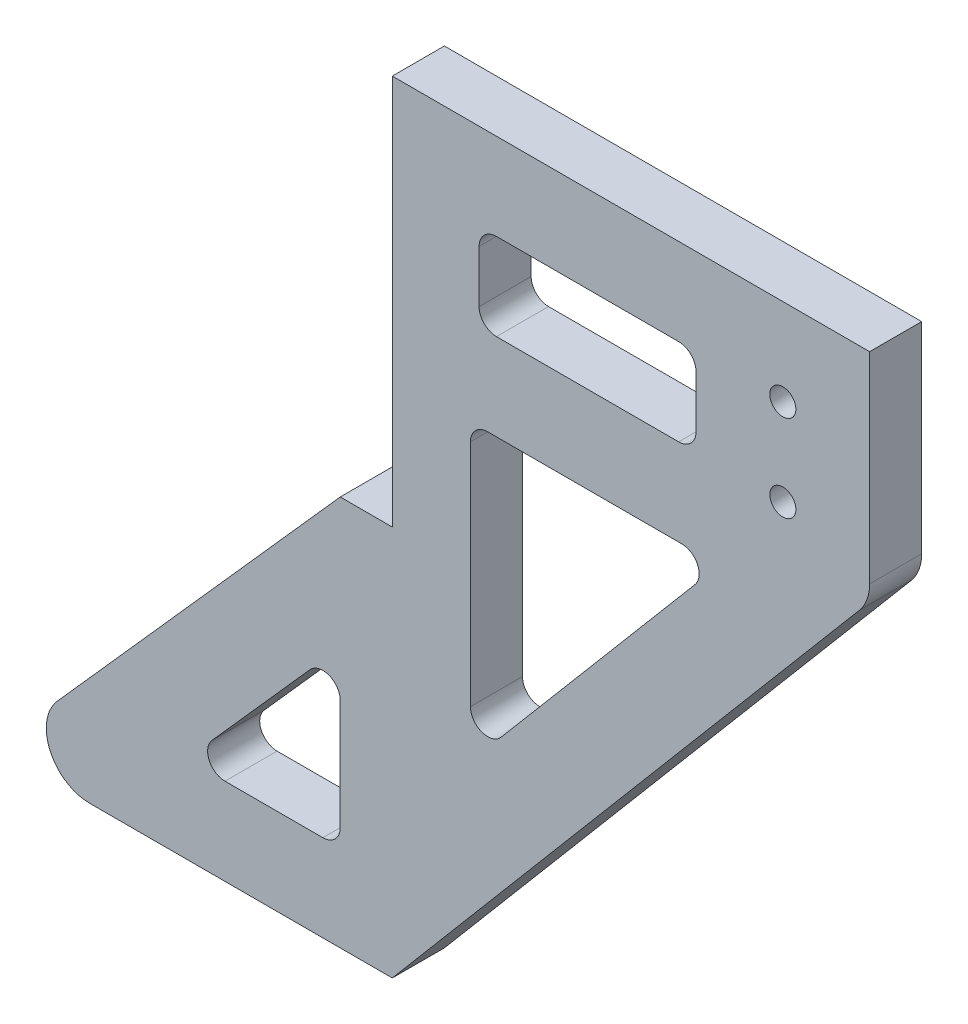
ISO-10303-21;
HEADER;
FILE_DESCRIPTION(('STEP AP214'),'2;1');
FILE_NAME('part.step','',(''),(''),'','','');
FILE_SCHEMA(('AUTOMOTIVE_DESIGN { 1 0 10303 214 1 1 1 1 }'));
ENDSEC;
DATA;
#1=APPLICATION_CONTEXT('core data for automotive mechanical design processes');
#2=APPLICATION_PROTOCOL_DEFINITION('international standard','automotive_design',2000,#1);
#3=PRODUCT_CONTEXT('',#1,'mechanical');
#4=PRODUCT('Part','Part','',(#3));
#5=PRODUCT_RELATED_PRODUCT_CATEGORY('part','',(#4));
#6=PRODUCT_DEFINITION_FORMATION('','',#4);
#7=PRODUCT_DEFINITION_CONTEXT('part definition',#1,'design');
#8=PRODUCT_DEFINITION('design','',#6,#7);
#9=PRODUCT_DEFINITION_SHAPE('','',#8);
#10=(LENGTH_UNIT() NAMED_UNIT(*) SI_UNIT(.MILLI.,.METRE.));
#11=(NAMED_UNIT(*) PLANE_ANGLE_UNIT() SI_UNIT($,.RADIAN.));
#12=(NAMED_UNIT(*) SI_UNIT($,.STERADIAN.) SOLID_ANGLE_UNIT());
#13=UNCERTAINTY_MEASURE_WITH_UNIT(LENGTH_MEASURE(1.E-05),#10,'distance_accuracy_value','');
#14=(GEOMETRIC_REPRESENTATION_CONTEXT(3) GLOBAL_UNCERTAINTY_ASSIGNED_CONTEXT((#13)) GLOBAL_UNIT_ASSIGNED_CONTEXT((#10,
#11,#12)) REPRESENTATION_CONTEXT('',''));
#15=CARTESIAN_POINT('',(0.,0.,0.));
#16=DIRECTION('',(0.,0.,1.));
#17=DIRECTION('',(1.,0.,0.));
#18=AXIS2_PLACEMENT_3D('',#15,#16,#17);
#19=CARTESIAN_POINT('',(0.,0.,6.));
#20=DIRECTION('',(1.,0.,0.));
#21=DIRECTION('',(0.,1.,0.));
#22=AXIS2_PLACEMENT_3D('',#19,#20,#21);
#23=PLANE('',#22);
#24=DIRECTION('',(0.,-1.,0.));
#25=VECTOR('',#24,1.);
#26=CARTESIAN_POINT('',(0.,0.,0.));
#27=LINE('',#26,#25);
#28=CARTESIAN_POINT('',(0.,0.,0.));
#29=VERTEX_POINT('',#28);
#30=CARTESIAN_POINT('',(0.,-45.,0.));
#31=VERTEX_POINT('',#30);
#32=EDGE_CURVE('E247',#29,#31,#27,.T.);
#33=ORIENTED_EDGE('',*,*,#32,.T.);
#34=DIRECTION('',(0.,0.,-1.));
#35=VECTOR('',#34,1.);
#36=CARTESIAN_POINT('',(0.,-45.,6.));
#37=LINE('',#36,#35);
#38=CARTESIAN_POINT('',(0.,-45.,6.));
#39=VERTEX_POINT('',#38);
#40=EDGE_CURVE('E229',#39,#31,#37,.T.);
#41=ORIENTED_EDGE('',*,*,#40,.F.);
#42=DIRECTION('',(0.,-1.,0.));
#43=VECTOR('',#42,1.);
#44=CARTESIAN_POINT('',(0.,0.,6.));
#45=LINE('',#44,#43);
#46=CARTESIAN_POINT('',(0.,0.,6.));
#47=VERTEX_POINT('',#46);
#48=EDGE_CURVE('E234',#47,#39,#45,.T.);
#49=ORIENTED_EDGE('',*,*,#48,.F.);
#50=DIRECTION('',(0.,0.,-1.));
#51=VECTOR('',#50,1.);
#52=CARTESIAN_POINT('',(0.,0.,6.));
#53=LINE('',#52,#51);
#54=EDGE_CURVE('E381',#47,#29,#53,.T.);
#55=ORIENTED_EDGE('',*,*,#54,.T.);
#56=EDGE_LOOP('',(#33,#41,#49,#55));
#57=FACE_BOUND('',#56,.T.);
#58=ADVANCED_FACE('F34',(#57),#23,.F.);
#59=CARTESIAN_POINT('',(0.,-45.,6.));
#60=DIRECTION('',(0.,-1.,0.));
#61=DIRECTION('',(0.,0.,-1.));
#62=AXIS2_PLACEMENT_3D('',#59,#60,#61);
#63=PLANE('',#62);
#64=DIRECTION('',(-1.,0.,0.));
#65=VECTOR('',#64,1.);
#66=CARTESIAN_POINT('',(0.,-45.,0.));
#67=LINE('',#66,#65);
#68=CARTESIAN_POINT('',(-6.,-45.,0.));
#69=VERTEX_POINT('',#68);
#70=EDGE_CURVE('E375',#31,#69,#67,.T.);
#71=ORIENTED_EDGE('',*,*,#70,.T.);
#72=DIRECTION('',(0.,0.,-1.));
#73=VECTOR('',#72,1.);
#74=CARTESIAN_POINT('',(-6.,-45.,6.));
#75=LINE('',#74,#73);
#76=CARTESIAN_POINT('',(-6.,-45.,6.));
#77=VERTEX_POINT('',#76);
#78=EDGE_CURVE('E232',#77,#69,#75,.T.);
#79=ORIENTED_EDGE('',*,*,#78,.F.);
#80=DIRECTION('',(-1.,0.,0.));
#81=VECTOR('',#80,1.);
#82=CARTESIAN_POINT('',(0.,-45.,6.));
#83=LINE('',#82,#81);
#84=EDGE_CURVE('E225',#39,#77,#83,.T.);
#85=ORIENTED_EDGE('',*,*,#84,.F.);
#86=ORIENTED_EDGE('',*,*,#40,.T.);
#87=EDGE_LOOP('',(#71,#79,#85,#86));
#88=FACE_BOUND('',#87,.T.);
#89=ADVANCED_FACE('F227',(#88),#63,.F.);
#90=CARTESIAN_POINT('',(-6.,-45.,6.));
#91=DIRECTION('',(0.74740931868366,-0.66436383882992,0.));
#92=DIRECTION('',(0.66436383882992,0.74740931868366,0.));
#93=AXIS2_PLACEMENT_3D('',#90,#91,#92);
#94=PLANE('',#93);
#95=DIRECTION('',(-0.66436383882992,-0.74740931868366,0.));
#96=VECTOR('',#95,1.);
#97=CARTESIAN_POINT('',(-6.,-45.,0.));
#98=LINE('',#97,#96);
#99=CARTESIAN_POINT('',(-38.6028273829781,-81.6781808058504,0.));
#100=VERTEX_POINT('',#99);
#101=EDGE_CURVE('E371',#69,#100,#98,.T.);
#102=ORIENTED_EDGE('',*,*,#101,.T.);
#103=DIRECTION('',(0.,0.,-1.));
#104=VECTOR('',#103,1.);
#105=CARTESIAN_POINT('',(-38.6028273829781,-81.6781808058504,6.));
#106=LINE('',#105,#104);
#107=CARTESIAN_POINT('',(-38.6028273829781,-81.6781808058504,6.));
#108=VERTEX_POINT('',#107);
#109=EDGE_CURVE('E11',#100,#108,#106,.F.);
#110=ORIENTED_EDGE('',*,*,#109,.T.);
#111=DIRECTION('',(-0.66436383882992,-0.74740931868366,0.));
#112=VECTOR('',#111,1.);
#113=CARTESIAN_POINT('',(-6.,-45.,6.));
#114=LINE('',#113,#112);
#115=EDGE_CURVE('E233',#77,#108,#114,.T.);
#116=ORIENTED_EDGE('',*,*,#115,.F.);
#117=ORIENTED_EDGE('',*,*,#78,.T.);
#118=EDGE_LOOP('',(#102,#110,#116,#117));
#119=FACE_BOUND('',#118,.T.);
#120=ADVANCED_FACE('F399',(#119),#94,.F.);
#121=CARTESIAN_POINT('',(-46.,-90.,6.));
#122=DIRECTION('',(0.,1.,0.));
#123=DIRECTION('',(0.,0.,1.));
#124=AXIS2_PLACEMENT_3D('',#121,#122,#123);
#125=PLANE('',#124);
#126=DIRECTION('',(1.,0.,0.));
#127=VECTOR('',#126,1.);
#128=CARTESIAN_POINT('',(-46.,-90.,6.));
#129=LINE('',#128,#127);
#130=CARTESIAN_POINT('',(-34.8657807895598,-90.,6.));
#131=VERTEX_POINT('',#130);
#132=CARTESIAN_POINT('',(0.,-90.,6.));
#133=VERTEX_POINT('',#132);
#134=EDGE_CURVE('E362',#131,#133,#129,.T.);
#135=ORIENTED_EDGE('',*,*,#134,.F.);
#136=DIRECTION('',(0.,0.,-1.));
#137=VECTOR('',#136,1.);
#138=CARTESIAN_POINT('',(-34.8657807895598,-90.,6.));
#139=LINE('',#138,#137);
#140=CARTESIAN_POINT('',(-34.8657807895598,-90.,0.));
#141=VERTEX_POINT('',#140);
#142=EDGE_CURVE('E42',#131,#141,#139,.T.);
#143=ORIENTED_EDGE('',*,*,#142,.T.);
#144=DIRECTION('',(1.,0.,0.));
#145=VECTOR('',#144,1.);
#146=CARTESIAN_POINT('',(-46.,-90.,0.));
#147=LINE('',#146,#145);
#148=CARTESIAN_POINT('',(0.,-90.,0.));
#149=VERTEX_POINT('',#148);
#150=EDGE_CURVE('E360',#141,#149,#147,.T.);
#151=ORIENTED_EDGE('',*,*,#150,.T.);
#152=DIRECTION('',(0.,0.,-1.));
#153=VECTOR('',#152,1.);
#154=CARTESIAN_POINT('',(0.,-90.,6.));
#155=LINE('',#154,#153);
#156=EDGE_CURVE('E252',#133,#149,#155,.T.);
#157=ORIENTED_EDGE('',*,*,#156,.F.);
#158=EDGE_LOOP('',(#135,#143,#151,#157));
#159=FACE_BOUND('',#158,.T.);
#160=ADVANCED_FACE('F358',(#159),#125,.F.);
#161=CARTESIAN_POINT('',(0.,-90.,6.));
#162=DIRECTION('',(-0.763386285369115,0.645942241466174,0.));
#163=DIRECTION('',(-0.645942241466174,-0.763386285369115,0.));
#164=AXIS2_PLACEMENT_3D('',#161,#162,#163);
#165=PLANE('',#164);
#166=DIRECTION('',(0.645942241466174,0.763386285369115,0.));
#167=VECTOR('',#166,1.);
#168=CARTESIAN_POINT('',(0.,-90.,0.));
#169=LINE('',#168,#167);
#170=CARTESIAN_POINT('',(53.8169314268456,-26.3981719500916,0.));
#171=VERTEX_POINT('',#170);
#172=EDGE_CURVE('E370',#149,#171,#169,.T.);
#173=ORIENTED_EDGE('',*,*,#172,.T.);
#174=DIRECTION('',(0.,0.,-1.));
#175=VECTOR('',#174,1.);
#176=CARTESIAN_POINT('',(53.8169314268456,-26.3981719500916,6.));
#177=LINE('',#176,#175);
#178=CARTESIAN_POINT('',(53.8169314268456,-26.3981719500916,6.));
#179=VERTEX_POINT('',#178);
#180=EDGE_CURVE('E350',#171,#179,#177,.F.);
#181=ORIENTED_EDGE('',*,*,#180,.T.);
#182=DIRECTION('',(0.645942241466174,0.763386285369115,0.));
#183=VECTOR('',#182,1.);
#184=CARTESIAN_POINT('',(0.,-90.,6.));
#185=LINE('',#184,#183);
#186=EDGE_CURVE('E389',#133,#179,#185,.T.);
#187=ORIENTED_EDGE('',*,*,#186,.F.);
#188=ORIENTED_EDGE('',*,*,#156,.T.);
#189=EDGE_LOOP('',(#173,#181,#187,#188));
#190=FACE_BOUND('',#189,.T.);
#191=ADVANCED_FACE('F387',(#190),#165,.F.);
#192=CARTESIAN_POINT('',(55.,0.,6.));
#193=DIRECTION('',(-1.,0.,0.));
#194=DIRECTION('',(0.,-1.,0.));
#195=AXIS2_PLACEMENT_3D('',#192,#193,#194);
#196=PLANE('',#195);
#197=DIRECTION('',(0.,1.,0.));
#198=VECTOR('',#197,1.);
#199=CARTESIAN_POINT('',(55.,0.,6.));
#200=LINE('',#199,#198);
#201=CARTESIAN_POINT('',(55.,-23.1684607427607,6.));
#202=VERTEX_POINT('',#201);
#203=CARTESIAN_POINT('',(55.,0.,6.));
#204=VERTEX_POINT('',#203);
#205=EDGE_CURVE('E391',#202,#204,#200,.T.);
#206=ORIENTED_EDGE('',*,*,#205,.F.);
#207=DIRECTION('',(0.,0.,-1.));
#208=VECTOR('',#207,1.);
#209=CARTESIAN_POINT('',(55.,-23.1684607427607,6.));
#210=LINE('',#209,#208);
#211=CARTESIAN_POINT('',(55.,-23.1684607427607,0.));
#212=VERTEX_POINT('',#211);
#213=EDGE_CURVE('E343',#202,#212,#210,.T.);
#214=ORIENTED_EDGE('',*,*,#213,.T.);
#215=DIRECTION('',(0.,1.,0.));
#216=VECTOR('',#215,1.);
#217=CARTESIAN_POINT('',(55.,0.,0.));
#218=LINE('',#217,#216);
#219=CARTESIAN_POINT('',(55.,0.,0.));
#220=VERTEX_POINT('',#219);
#221=EDGE_CURVE('E373',#212,#220,#218,.T.);
#222=ORIENTED_EDGE('',*,*,#221,.T.);
#223=DIRECTION('',(0.,0.,-1.));
#224=VECTOR('',#223,1.);
#225=CARTESIAN_POINT('',(55.,0.,6.));
#226=LINE('',#225,#224);
#227=EDGE_CURVE('E383',#204,#220,#226,.T.);
#228=ORIENTED_EDGE('',*,*,#227,.F.);
#229=EDGE_LOOP('',(#206,#214,#222,#228));
#230=FACE_BOUND('',#229,.T.);
#231=ADVANCED_FACE('F574',(#230),#196,.F.);
#232=CARTESIAN_POINT('',(0.,0.,6.));
#233=DIRECTION('',(0.,-1.,0.));
#234=DIRECTION('',(0.,0.,-1.));
#235=AXIS2_PLACEMENT_3D('',#232,#233,#234);
#236=PLANE('',#235);
#237=DIRECTION('',(-1.,0.,0.));
#238=VECTOR('',#237,1.);
#239=CARTESIAN_POINT('',(0.,0.,0.));
#240=LINE('',#239,#238);
#241=EDGE_CURVE('E244',#220,#29,#240,.T.);
#242=ORIENTED_EDGE('',*,*,#241,.T.);
#243=ORIENTED_EDGE('',*,*,#54,.F.);
#244=DIRECTION('',(-1.,0.,0.));
#245=VECTOR('',#244,1.);
#246=CARTESIAN_POINT('',(0.,0.,6.));
#247=LINE('',#246,#245);
#248=EDGE_CURVE('E240',#204,#47,#247,.T.);
#249=ORIENTED_EDGE('',*,*,#248,.F.);
#250=ORIENTED_EDGE('',*,*,#227,.T.);
#251=EDGE_LOOP('',(#242,#243,#249,#250));
#252=FACE_BOUND('',#251,.T.);
#253=ADVANCED_FACE('F577',(#252),#236,.F.);
#254=CARTESIAN_POINT('',(0.,0.,6.));
#255=DIRECTION('',(0.,0.,-1.));
#256=DIRECTION('',(-1.,0.,0.));
#257=AXIS2_PLACEMENT_3D('',#254,#255,#256);
#258=PLANE('',#257);
#259=CARTESIAN_POINT('',(45.,-10.,6.));
#260=DIRECTION('',(0.,0.,-1.));
#261=DIRECTION('',(-1.,0.,0.));
#262=AXIS2_PLACEMENT_3D('',#259,#260,#261);
#263=CIRCLE('',#262,1.5);
#264=CARTESIAN_POINT('',(43.5,-10.,6.));
#265=VERTEX_POINT('',#264);
#266=EDGE_CURVE('E398',#265,#265,#263,.T.);
#267=ORIENTED_EDGE('',*,*,#266,.T.);
#268=EDGE_LOOP('',(#267));
#269=FACE_BOUND('',#268,.T.);
#270=CARTESIAN_POINT('',(45.,-20.,6.));
#271=DIRECTION('',(0.,0.,-1.));
#272=DIRECTION('',(-1.,0.,0.));
#273=AXIS2_PLACEMENT_3D('',#270,#271,#272);
#274=CIRCLE('',#273,1.5);
#275=CARTESIAN_POINT('',(43.5,-20.,6.));
#276=VERTEX_POINT('',#275);
#277=EDGE_CURVE('E403',#276,#276,#274,.T.);
#278=ORIENTED_EDGE('',*,*,#277,.T.);
#279=EDGE_LOOP('',(#278));
#280=FACE_BOUND('',#279,.T.);
#281=DIRECTION('',(-1.,0.,0.));
#282=VECTOR('',#281,1.);
#283=CARTESIAN_POINT('',(0.,-80.,6.));
#284=LINE('',#283,#282);
#285=CARTESIAN_POINT('',(-7.99999999999999,-80.,6.));
#286=VERTEX_POINT('',#285);
#287=CARTESIAN_POINT('',(-19.2778738949436,-80.,6.));
#288=VERTEX_POINT('',#287);
#289=EDGE_CURVE('E409',#286,#288,#284,.T.);
#290=ORIENTED_EDGE('',*,*,#289,.T.);
#291=CARTESIAN_POINT('',(-19.2778738949436,-78.,6.));
#292=DIRECTION('',(0.,0.,-1.));
#293=DIRECTION('',(-1.,0.,0.));
#294=AXIS2_PLACEMENT_3D('',#291,#292,#293);
#295=CIRCLE('',#294,2.);
#296=CARTESIAN_POINT('',(-20.7726925323109,-76.6712723223402,6.));
#297=VERTEX_POINT('',#296);
#298=EDGE_CURVE('E304',#288,#297,#295,.T.);
#299=ORIENTED_EDGE('',*,*,#298,.T.);
#300=DIRECTION('',(0.66436383882992,0.74740931868366,0.));
#301=VECTOR('',#300,1.);
#302=CARTESIAN_POINT('',(26.4671966351125,-23.5263970089889,6.));
#303=LINE('',#302,#301);
#304=CARTESIAN_POINT('',(-9.49481863736731,-63.9836641905286,6.));
#305=VERTEX_POINT('',#304);
#306=EDGE_CURVE('E412',#297,#305,#303,.T.);
#307=ORIENTED_EDGE('',*,*,#306,.T.);
#308=CARTESIAN_POINT('',(-8.,-65.3123918681885,6.));
#309=DIRECTION('',(0.,0.,-1.));
#310=DIRECTION('',(-1.,0.,0.));
#311=AXIS2_PLACEMENT_3D('',#308,#309,#310);
#312=CIRCLE('',#311,2.);
#313=CARTESIAN_POINT('',(-6.,-65.3123918681885,6.));
#314=VERTEX_POINT('',#313);
#315=EDGE_CURVE('E312',#305,#314,#312,.T.);
#316=ORIENTED_EDGE('',*,*,#315,.T.);
#317=DIRECTION('',(0.,-1.,0.));
#318=VECTOR('',#317,1.);
#319=CARTESIAN_POINT('',(-6.,0.,6.));
#320=LINE('',#319,#318);
#321=CARTESIAN_POINT('',(-5.99999999999999,-78.,6.));
#322=VERTEX_POINT('',#321);
#323=EDGE_CURVE('E406',#314,#322,#320,.T.);
#324=ORIENTED_EDGE('',*,*,#323,.T.);
#325=CARTESIAN_POINT('',(-7.99999999999999,-78.,6.));
#326=DIRECTION('',(0.,0.,-1.));
#327=DIRECTION('',(-1.,0.,0.));
#328=AXIS2_PLACEMENT_3D('',#325,#326,#327);
#329=CIRCLE('',#328,2.);
#330=EDGE_CURVE('E308',#322,#286,#329,.T.);
#331=ORIENTED_EDGE('',*,*,#330,.T.);
#332=EDGE_LOOP('',(#290,#299,#307,#316,#324,#331));
#333=FACE_BOUND('',#332,.T.);
#334=DIRECTION('',(0.,-1.,0.));
#335=VECTOR('',#334,1.);
#336=CARTESIAN_POINT('',(35.,0.,6.));
#337=LINE('',#336,#335);
#338=CARTESIAN_POINT('',(35.,-12.,6.));
#339=VERTEX_POINT('',#338);
#340=CARTESIAN_POINT('',(35.,-18.,6.));
#341=VERTEX_POINT('',#340);
#342=EDGE_CURVE('E421',#339,#341,#337,.T.);
#343=ORIENTED_EDGE('',*,*,#342,.T.);
#344=CARTESIAN_POINT('',(33.,-18.,6.));
#345=DIRECTION('',(0.,0.,-1.));
#346=DIRECTION('',(-1.,0.,0.));
#347=AXIS2_PLACEMENT_3D('',#344,#345,#346);
#348=CIRCLE('',#347,2.);
#349=CARTESIAN_POINT('',(33.,-20.,6.));
#350=VERTEX_POINT('',#349);
#351=EDGE_CURVE('E292',#341,#350,#348,.T.);
#352=ORIENTED_EDGE('',*,*,#351,.T.);
#353=DIRECTION('',(-1.,0.,0.));
#354=VECTOR('',#353,1.);
#355=CARTESIAN_POINT('',(0.,-20.,6.));
#356=LINE('',#355,#354);
#357=CARTESIAN_POINT('',(12.,-20.,6.));
#358=VERTEX_POINT('',#357);
#359=EDGE_CURVE('E424',#350,#358,#356,.T.);
#360=ORIENTED_EDGE('',*,*,#359,.T.);
#361=CARTESIAN_POINT('',(12.,-18.,6.));
#362=DIRECTION('',(0.,0.,-1.));
#363=DIRECTION('',(-1.,0.,0.));
#364=AXIS2_PLACEMENT_3D('',#361,#362,#363);
#365=CIRCLE('',#364,2.);
#366=CARTESIAN_POINT('',(10.,-18.,6.));
#367=VERTEX_POINT('',#366);
#368=EDGE_CURVE('E288',#358,#367,#365,.T.);
#369=ORIENTED_EDGE('',*,*,#368,.T.);
#370=DIRECTION('',(0.,1.,0.));
#371=VECTOR('',#370,1.);
#372=CARTESIAN_POINT('',(10.,0.,6.));
#373=LINE('',#372,#371);
#374=CARTESIAN_POINT('',(10.,-12.,6.));
#375=VERTEX_POINT('',#374);
#376=EDGE_CURVE('E415',#367,#375,#373,.T.);
#377=ORIENTED_EDGE('',*,*,#376,.T.);
#378=CARTESIAN_POINT('',(12.,-12.,6.));
#379=DIRECTION('',(0.,0.,-1.));
#380=DIRECTION('',(-1.,0.,0.));
#381=AXIS2_PLACEMENT_3D('',#378,#379,#380);
#382=CIRCLE('',#381,2.);
#383=CARTESIAN_POINT('',(12.,-10.,6.));
#384=VERTEX_POINT('',#383);
#385=EDGE_CURVE('E296',#375,#384,#382,.T.);
#386=ORIENTED_EDGE('',*,*,#385,.T.);
#387=DIRECTION('',(1.,0.,0.));
#388=VECTOR('',#387,1.);
#389=CARTESIAN_POINT('',(0.,-10.,6.));
#390=LINE('',#389,#388);
#391=CARTESIAN_POINT('',(33.,-10.,6.));
#392=VERTEX_POINT('',#391);
#393=EDGE_CURVE('E418',#384,#392,#390,.T.);
#394=ORIENTED_EDGE('',*,*,#393,.T.);
#395=CARTESIAN_POINT('',(33.,-12.,6.));
#396=DIRECTION('',(0.,0.,-1.));
#397=DIRECTION('',(-1.,0.,0.));
#398=AXIS2_PLACEMENT_3D('',#395,#396,#397);
#399=CIRCLE('',#398,2.);
#400=EDGE_CURVE('E300',#392,#339,#399,.T.);
#401=ORIENTED_EDGE('',*,*,#400,.T.);
#402=EDGE_LOOP('',(#343,#352,#360,#369,#377,#386,#394,#401));
#403=FACE_BOUND('',#402,.T.);
#404=DIRECTION('',(-0.645942241466174,-0.763386285369115,0.));
#405=VECTOR('',#404,1.);
#406=CARTESIAN_POINT('',(36.7454474911364,-31.0923017232693,6.));
#407=LINE('',#406,#405);
#408=CARTESIAN_POINT('',(34.8842620791138,-33.2918844829323,6.));
#409=VERTEX_POINT('',#408);
#410=CARTESIAN_POINT('',(12.5267725707382,-59.7143720837399,6.));
#411=VERTEX_POINT('',#410);
#412=EDGE_CURVE('E430',#409,#411,#407,.T.);
#413=ORIENTED_EDGE('',*,*,#412,.T.);
#414=CARTESIAN_POINT('',(11.,-58.4224876008075,6.));
#415=DIRECTION('',(0.,0.,-1.));
#416=DIRECTION('',(-1.,0.,0.));
#417=AXIS2_PLACEMENT_3D('',#414,#415,#416);
#418=CIRCLE('',#417,2.);
#419=CARTESIAN_POINT('',(9.00000000000001,-58.4224876008075,6.));
#420=VERTEX_POINT('',#419);
#421=EDGE_CURVE('E331',#411,#420,#418,.T.);
#422=ORIENTED_EDGE('',*,*,#421,.T.);
#423=DIRECTION('',(0.,1.,0.));
#424=VECTOR('',#423,1.);
#425=CARTESIAN_POINT('',(8.99999999999999,0.,6.));
#426=LINE('',#425,#424);
#427=CARTESIAN_POINT('',(9.,-32.,6.));
#428=VERTEX_POINT('',#427);
#429=EDGE_CURVE('E433',#420,#428,#426,.T.);
#430=ORIENTED_EDGE('',*,*,#429,.T.);
#431=CARTESIAN_POINT('',(11.,-32.,6.));
#432=DIRECTION('',(0.,0.,-1.));
#433=DIRECTION('',(-1.,0.,0.));
#434=AXIS2_PLACEMENT_3D('',#431,#432,#433);
#435=CIRCLE('',#434,2.);
#436=CARTESIAN_POINT('',(11.,-30.,6.));
#437=VERTEX_POINT('',#436);
#438=EDGE_CURVE('E335',#428,#437,#435,.T.);
#439=ORIENTED_EDGE('',*,*,#438,.T.);
#440=DIRECTION('',(1.,0.,0.));
#441=VECTOR('',#440,1.);
#442=CARTESIAN_POINT('',(0.,-30.,6.));
#443=LINE('',#442,#441);
#444=CARTESIAN_POINT('',(33.3574895083756,-30.,6.));
#445=VERTEX_POINT('',#444);
#446=EDGE_CURVE('E427',#437,#445,#443,.T.);
#447=ORIENTED_EDGE('',*,*,#446,.T.);
#448=CARTESIAN_POINT('',(33.3574895083756,-32.,6.));
#449=DIRECTION('',(0.,0.,-1.));
#450=DIRECTION('',(-1.,0.,0.));
#451=AXIS2_PLACEMENT_3D('',#448,#449,#450);
#452=CIRCLE('',#451,2.);
#453=EDGE_CURVE('E339',#445,#409,#452,.T.);
#454=ORIENTED_EDGE('',*,*,#453,.T.);
#455=EDGE_LOOP('',(#413,#422,#430,#439,#447,#454));
#456=FACE_BOUND('',#455,.T.);
#457=ORIENTED_EDGE('',*,*,#186,.T.);
#458=CARTESIAN_POINT('',(50.,-23.1684607427607,6.));
#459=DIRECTION('',(0.,0.,-1.));
#460=DIRECTION('',(-1.,0.,0.));
#461=AXIS2_PLACEMENT_3D('',#458,#459,#460);
#462=CIRCLE('',#461,5.);
#463=EDGE_CURVE('E353',#179,#202,#462,.F.);
#464=ORIENTED_EDGE('',*,*,#463,.T.);
#465=ORIENTED_EDGE('',*,*,#205,.T.);
#466=ORIENTED_EDGE('',*,*,#248,.T.);
#467=ORIENTED_EDGE('',*,*,#48,.T.);
#468=ORIENTED_EDGE('',*,*,#84,.T.);
#469=ORIENTED_EDGE('',*,*,#115,.T.);
#470=CARTESIAN_POINT('',(-34.8657807895598,-85.,6.));
#471=DIRECTION('',(0.,0.,-1.));
#472=DIRECTION('',(-1.,0.,0.));
#473=AXIS2_PLACEMENT_3D('',#470,#471,#472);
#474=CIRCLE('',#473,5.);
#475=EDGE_CURVE('E49',#108,#131,#474,.F.);
#476=ORIENTED_EDGE('',*,*,#475,.T.);
#477=ORIENTED_EDGE('',*,*,#134,.T.);
#478=EDGE_LOOP('',(#457,#464,#465,#466,#467,#468,#469,#476,#477));
#479=FACE_BOUND('',#478,.T.);
#480=ADVANCED_FACE('F238',(#269,#280,#333,#403,#456,#479),#258,.F.);
#481=CARTESIAN_POINT('',(0.,0.,0.));
#482=DIRECTION('',(0.,0.,-1.));
#483=DIRECTION('',(-1.,0.,0.));
#484=AXIS2_PLACEMENT_3D('',#481,#482,#483);
#485=PLANE('',#484);
#486=CARTESIAN_POINT('',(45.,-10.,0.));
#487=DIRECTION('',(0.,0.,1.));
#488=DIRECTION('',(1.,0.,0.));
#489=AXIS2_PLACEMENT_3D('',#486,#487,#488);
#490=CIRCLE('',#489,1.5);
#491=CARTESIAN_POINT('',(46.5,-10.,0.));
#492=VERTEX_POINT('',#491);
#493=EDGE_CURVE('E446',#492,#492,#490,.T.);
#494=ORIENTED_EDGE('',*,*,#493,.T.);
#495=EDGE_LOOP('',(#494));
#496=FACE_BOUND('',#495,.T.);
#497=CARTESIAN_POINT('',(45.,-20.,0.));
#498=DIRECTION('',(0.,0.,1.));
#499=DIRECTION('',(1.,0.,0.));
#500=AXIS2_PLACEMENT_3D('',#497,#498,#499);
#501=CIRCLE('',#500,1.5);
#502=CARTESIAN_POINT('',(46.5,-20.,0.));
#503=VERTEX_POINT('',#502);
#504=EDGE_CURVE('E449',#503,#503,#501,.T.);
#505=ORIENTED_EDGE('',*,*,#504,.T.);
#506=EDGE_LOOP('',(#505));
#507=FACE_BOUND('',#506,.T.);
#508=DIRECTION('',(1.,0.,0.));
#509=VECTOR('',#508,1.);
#510=CARTESIAN_POINT('',(-23.7315615791197,-80.,0.));
#511=LINE('',#510,#509);
#512=CARTESIAN_POINT('',(-19.2778738949436,-80.,0.));
#513=VERTEX_POINT('',#512);
#514=CARTESIAN_POINT('',(-7.99999999999999,-80.,0.));
#515=VERTEX_POINT('',#514);
#516=EDGE_CURVE('E453',#513,#515,#511,.T.);
#517=ORIENTED_EDGE('',*,*,#516,.T.);
#518=CARTESIAN_POINT('',(-7.99999999999999,-78.,0.));
#519=DIRECTION('',(0.,0.,-1.));
#520=DIRECTION('',(-1.,0.,0.));
#521=AXIS2_PLACEMENT_3D('',#518,#519,#520);
#522=CIRCLE('',#521,2.);
#523=CARTESIAN_POINT('',(-5.99999999999999,-78.,0.));
#524=VERTEX_POINT('',#523);
#525=EDGE_CURVE('E310',#515,#524,#522,.F.);
#526=ORIENTED_EDGE('',*,*,#525,.T.);
#527=DIRECTION('',(0.,1.,0.));
#528=VECTOR('',#527,1.);
#529=CARTESIAN_POINT('',(-5.99999999999999,-80.,0.));
#530=LINE('',#529,#528);
#531=CARTESIAN_POINT('',(-6.,-65.3123918681885,0.));
#532=VERTEX_POINT('',#531);
#533=EDGE_CURVE('E452',#524,#532,#530,.T.);
#534=ORIENTED_EDGE('',*,*,#533,.T.);
#535=CARTESIAN_POINT('',(-8.,-65.3123918681885,0.));
#536=DIRECTION('',(0.,0.,-1.));
#537=DIRECTION('',(-1.,0.,0.));
#538=AXIS2_PLACEMENT_3D('',#535,#536,#537);
#539=CIRCLE('',#538,2.);
#540=CARTESIAN_POINT('',(-9.49481863736731,-63.9836641905286,0.));
#541=VERTEX_POINT('',#540);
#542=EDGE_CURVE('E314',#532,#541,#539,.F.);
#543=ORIENTED_EDGE('',*,*,#542,.T.);
#544=DIRECTION('',(-0.66436383882992,-0.74740931868366,0.));
#545=VECTOR('',#544,1.);
#546=CARTESIAN_POINT('',(-6.,-60.0519932234904,0.));
#547=LINE('',#546,#545);
#548=CARTESIAN_POINT('',(-20.7726925323109,-76.6712723223402,0.));
#549=VERTEX_POINT('',#548);
#550=EDGE_CURVE('E457',#541,#549,#547,.T.);
#551=ORIENTED_EDGE('',*,*,#550,.T.);
#552=CARTESIAN_POINT('',(-19.2778738949436,-78.,0.));
#553=DIRECTION('',(0.,0.,-1.));
#554=DIRECTION('',(-1.,0.,0.));
#555=AXIS2_PLACEMENT_3D('',#552,#553,#554);
#556=CIRCLE('',#555,2.);
#557=EDGE_CURVE('E306',#549,#513,#556,.F.);
#558=ORIENTED_EDGE('',*,*,#557,.T.);
#559=EDGE_LOOP('',(#517,#526,#534,#543,#551,#558));
#560=FACE_BOUND('',#559,.T.);
#561=DIRECTION('',(-1.,0.,0.));
#562=VECTOR('',#561,1.);
#563=CARTESIAN_POINT('',(10.,-10.,0.));
#564=LINE('',#563,#562);
#565=CARTESIAN_POINT('',(33.,-10.,0.));
#566=VERTEX_POINT('',#565);
#567=CARTESIAN_POINT('',(12.,-10.,0.));
#568=VERTEX_POINT('',#567);
#569=EDGE_CURVE('E445',#566,#568,#564,.T.);
#570=ORIENTED_EDGE('',*,*,#569,.T.);
#571=CARTESIAN_POINT('',(12.,-12.,0.));
#572=DIRECTION('',(0.,0.,-1.));
#573=DIRECTION('',(-1.,0.,0.));
#574=AXIS2_PLACEMENT_3D('',#571,#572,#573);
#575=CIRCLE('',#574,2.);
#576=CARTESIAN_POINT('',(10.,-12.,0.));
#577=VERTEX_POINT('',#576);
#578=EDGE_CURVE('E298',#568,#577,#575,.F.);
#579=ORIENTED_EDGE('',*,*,#578,.T.);
#580=DIRECTION('',(0.,-1.,0.));
#581=VECTOR('',#580,1.);
#582=CARTESIAN_POINT('',(10.,-20.,0.));
#583=LINE('',#582,#581);
#584=CARTESIAN_POINT('',(10.,-18.,0.));
#585=VERTEX_POINT('',#584);
#586=EDGE_CURVE('E456',#577,#585,#583,.T.);
#587=ORIENTED_EDGE('',*,*,#586,.T.);
#588=CARTESIAN_POINT('',(12.,-18.,0.));
#589=DIRECTION('',(0.,0.,-1.));
#590=DIRECTION('',(-1.,0.,0.));
#591=AXIS2_PLACEMENT_3D('',#588,#589,#590);
#592=CIRCLE('',#591,2.);
#593=CARTESIAN_POINT('',(12.,-20.,0.));
#594=VERTEX_POINT('',#593);
#595=EDGE_CURVE('E290',#585,#594,#592,.F.);
#596=ORIENTED_EDGE('',*,*,#595,.T.);
#597=DIRECTION('',(1.,0.,0.));
#598=VECTOR('',#597,1.);
#599=CARTESIAN_POINT('',(10.,-20.,0.));
#600=LINE('',#599,#598);
#601=CARTESIAN_POINT('',(33.,-20.,0.));
#602=VERTEX_POINT('',#601);
#603=EDGE_CURVE('E467',#594,#602,#600,.T.);
#604=ORIENTED_EDGE('',*,*,#603,.T.);
#605=CARTESIAN_POINT('',(33.,-18.,0.));
#606=DIRECTION('',(0.,0.,-1.));
#607=DIRECTION('',(-1.,0.,0.));
#608=AXIS2_PLACEMENT_3D('',#605,#606,#607);
#609=CIRCLE('',#608,2.);
#610=CARTESIAN_POINT('',(35.,-18.,0.));
#611=VERTEX_POINT('',#610);
#612=EDGE_CURVE('E294',#602,#611,#609,.F.);
#613=ORIENTED_EDGE('',*,*,#612,.T.);
#614=DIRECTION('',(0.,1.,0.));
#615=VECTOR('',#614,1.);
#616=CARTESIAN_POINT('',(35.,-20.,0.));
#617=LINE('',#616,#615);
#618=CARTESIAN_POINT('',(35.,-12.,0.));
#619=VERTEX_POINT('',#618);
#620=EDGE_CURVE('E464',#611,#619,#617,.T.);
#621=ORIENTED_EDGE('',*,*,#620,.T.);
#622=CARTESIAN_POINT('',(33.,-12.,0.));
#623=DIRECTION('',(0.,0.,-1.));
#624=DIRECTION('',(-1.,0.,0.));
#625=AXIS2_PLACEMENT_3D('',#622,#623,#624);
#626=CIRCLE('',#625,2.);
#627=EDGE_CURVE('E302',#619,#566,#626,.F.);
#628=ORIENTED_EDGE('',*,*,#627,.T.);
#629=EDGE_LOOP('',(#570,#579,#587,#596,#604,#613,#621,#628));
#630=FACE_BOUND('',#629,.T.);
#631=DIRECTION('',(0.645942241466174,0.763386285369115,0.));
#632=VECTOR('',#631,1.);
#633=CARTESIAN_POINT('',(37.6697027954412,-30.,0.));
#634=LINE('',#633,#632);
#635=CARTESIAN_POINT('',(12.5267725707382,-59.7143720837399,0.));
#636=VERTEX_POINT('',#635);
#637=CARTESIAN_POINT('',(34.8842620791138,-33.2918844829323,0.));
#638=VERTEX_POINT('',#637);
#639=EDGE_CURVE('E436',#636,#638,#634,.T.);
#640=ORIENTED_EDGE('',*,*,#639,.T.);
#641=CARTESIAN_POINT('',(33.3574895083756,-32.,0.));
#642=DIRECTION('',(0.,0.,-1.));
#643=DIRECTION('',(-1.,0.,0.));
#644=AXIS2_PLACEMENT_3D('',#641,#642,#643);
#645=CIRCLE('',#644,2.);
#646=CARTESIAN_POINT('',(33.3574895083756,-30.,0.));
#647=VERTEX_POINT('',#646);
#648=EDGE_CURVE('E341',#638,#647,#645,.F.);
#649=ORIENTED_EDGE('',*,*,#648,.T.);
#650=DIRECTION('',(-1.,0.,0.));
#651=VECTOR('',#650,1.);
#652=CARTESIAN_POINT('',(9.,-30.,0.));
#653=LINE('',#652,#651);
#654=CARTESIAN_POINT('',(11.,-30.,0.));
#655=VERTEX_POINT('',#654);
#656=EDGE_CURVE('E442',#647,#655,#653,.T.);
#657=ORIENTED_EDGE('',*,*,#656,.T.);
#658=CARTESIAN_POINT('',(11.,-32.,0.));
#659=DIRECTION('',(0.,0.,-1.));
#660=DIRECTION('',(-1.,0.,0.));
#661=AXIS2_PLACEMENT_3D('',#658,#659,#660);
#662=CIRCLE('',#661,2.);
#663=CARTESIAN_POINT('',(9.,-32.,0.));
#664=VERTEX_POINT('',#663);
#665=EDGE_CURVE('E337',#655,#664,#662,.F.);
#666=ORIENTED_EDGE('',*,*,#665,.T.);
#667=DIRECTION('',(0.,-1.,0.));
#668=VECTOR('',#667,1.);
#669=CARTESIAN_POINT('',(9.,-30.,0.));
#670=LINE('',#669,#668);
#671=CARTESIAN_POINT('',(9.00000000000001,-58.4224876008075,0.));
#672=VERTEX_POINT('',#671);
#673=EDGE_CURVE('E439',#664,#672,#670,.T.);
#674=ORIENTED_EDGE('',*,*,#673,.T.);
#675=CARTESIAN_POINT('',(11.,-58.4224876008075,0.));
#676=DIRECTION('',(0.,0.,-1.));
#677=DIRECTION('',(-1.,0.,0.));
#678=AXIS2_PLACEMENT_3D('',#675,#676,#677);
#679=CIRCLE('',#678,2.);
#680=EDGE_CURVE('E333',#672,#636,#679,.F.);
#681=ORIENTED_EDGE('',*,*,#680,.T.);
#682=EDGE_LOOP('',(#640,#649,#657,#666,#674,#681));
#683=FACE_BOUND('',#682,.T.);
#684=ORIENTED_EDGE('',*,*,#221,.F.);
#685=CARTESIAN_POINT('',(50.,-23.1684607427607,0.));
#686=DIRECTION('',(0.,0.,-1.));
#687=DIRECTION('',(-1.,0.,0.));
#688=AXIS2_PLACEMENT_3D('',#685,#686,#687);
#689=CIRCLE('',#688,5.);
#690=EDGE_CURVE('E348',#212,#171,#689,.T.);
#691=ORIENTED_EDGE('',*,*,#690,.T.);
#692=ORIENTED_EDGE('',*,*,#172,.F.);
#693=ORIENTED_EDGE('',*,*,#150,.F.);
#694=CARTESIAN_POINT('',(-34.8657807895598,-85.,0.));
#695=DIRECTION('',(0.,0.,-1.));
#696=DIRECTION('',(-1.,0.,0.));
#697=AXIS2_PLACEMENT_3D('',#694,#695,#696);
#698=CIRCLE('',#697,5.);
#699=EDGE_CURVE('E346',#141,#100,#698,.T.);
#700=ORIENTED_EDGE('',*,*,#699,.T.);
#701=ORIENTED_EDGE('',*,*,#101,.F.);
#702=ORIENTED_EDGE('',*,*,#70,.F.);
#703=ORIENTED_EDGE('',*,*,#32,.F.);
#704=ORIENTED_EDGE('',*,*,#241,.F.);
#705=EDGE_LOOP('',(#684,#691,#692,#693,#700,#701,#702,#703,#704));
#706=FACE_BOUND('',#705,.T.);
#707=ADVANCED_FACE('F367',(#496,#507,#560,#630,#683,#706),#485,.T.);
#708=CARTESIAN_POINT('',(9.,-30.,0.));
#709=DIRECTION('',(0.,1.,0.));
#710=DIRECTION('',(-1.,0.,0.));
#711=AXIS2_PLACEMENT_3D('',#708,#709,#710);
#712=PLANE('',#711);
#713=ORIENTED_EDGE('',*,*,#446,.F.);
#714=DIRECTION('',(0.,0.,1.));
#715=VECTOR('',#714,1.);
#716=CARTESIAN_POINT('',(11.,-30.,0.));
#717=LINE('',#716,#715);
#718=EDGE_CURVE('E329',#437,#655,#717,.F.);
#719=ORIENTED_EDGE('',*,*,#718,.T.);
#720=ORIENTED_EDGE('',*,*,#656,.F.);
#721=DIRECTION('',(0.,0.,1.));
#722=VECTOR('',#721,1.);
#723=CARTESIAN_POINT('',(33.3574895083756,-30.,6.));
#724=LINE('',#723,#722);
#725=EDGE_CURVE('E326',#647,#445,#724,.T.);
#726=ORIENTED_EDGE('',*,*,#725,.T.);
#727=EDGE_LOOP('',(#713,#719,#720,#726));
#728=FACE_BOUND('',#727,.T.);
#729=ADVANCED_FACE('F625',(#728),#712,.F.);
#730=CARTESIAN_POINT('',(37.6697027954412,-30.,0.));
#731=DIRECTION('',(0.763386285369115,-0.645942241466174,0.));
#732=DIRECTION('',(0.645942241466174,0.763386285369115,0.));
#733=AXIS2_PLACEMENT_3D('',#730,#731,#732);
#734=PLANE('',#733);
#735=ORIENTED_EDGE('',*,*,#639,.F.);
#736=DIRECTION('',(0.,0.,1.));
#737=VECTOR('',#736,1.);
#738=CARTESIAN_POINT('',(12.5267725707382,-59.7143720837399,6.));
#739=LINE('',#738,#737);
#740=EDGE_CURVE('E318',#636,#411,#739,.T.);
#741=ORIENTED_EDGE('',*,*,#740,.T.);
#742=ORIENTED_EDGE('',*,*,#412,.F.);
#743=DIRECTION('',(0.,0.,1.));
#744=VECTOR('',#743,1.);
#745=CARTESIAN_POINT('',(34.8842620791138,-33.2918844829323,0.));
#746=LINE('',#745,#744);
#747=EDGE_CURVE('E316',#409,#638,#746,.F.);
#748=ORIENTED_EDGE('',*,*,#747,.T.);
#749=EDGE_LOOP('',(#735,#741,#742,#748));
#750=FACE_BOUND('',#749,.T.);
#751=ADVANCED_FACE('F519',(#750),#734,.F.);
#752=CARTESIAN_POINT('',(9.,-30.,0.));
#753=DIRECTION('',(-1.,0.,0.));
#754=DIRECTION('',(0.,-1.,0.));
#755=AXIS2_PLACEMENT_3D('',#752,#753,#754);
#756=PLANE('',#755);
#757=ORIENTED_EDGE('',*,*,#429,.F.);
#758=DIRECTION('',(0.,0.,1.));
#759=VECTOR('',#758,1.);
#760=CARTESIAN_POINT('',(9.00000000000001,-58.4224876008075,0.));
#761=LINE('',#760,#759);
#762=EDGE_CURVE('E324',#420,#672,#761,.F.);
#763=ORIENTED_EDGE('',*,*,#762,.T.);
#764=ORIENTED_EDGE('',*,*,#673,.F.);
#765=DIRECTION('',(0.,0.,1.));
#766=VECTOR('',#765,1.);
#767=CARTESIAN_POINT('',(9.,-32.,6.));
#768=LINE('',#767,#766);
#769=EDGE_CURVE('E321',#664,#428,#768,.T.);
#770=ORIENTED_EDGE('',*,*,#769,.T.);
#771=EDGE_LOOP('',(#757,#763,#764,#770));
#772=FACE_BOUND('',#771,.T.);
#773=ADVANCED_FACE('F512',(#772),#756,.F.);
#774=CARTESIAN_POINT('',(10.,-20.,0.));
#775=DIRECTION('',(-1.,0.,0.));
#776=DIRECTION('',(0.,0.,1.));
#777=AXIS2_PLACEMENT_3D('',#774,#775,#776);
#778=PLANE('',#777);
#779=ORIENTED_EDGE('',*,*,#376,.F.);
#780=DIRECTION('',(0.,0.,1.));
#781=VECTOR('',#780,1.);
#782=CARTESIAN_POINT('',(10.,-18.,0.));
#783=LINE('',#782,#781);
#784=EDGE_CURVE('E261',#367,#585,#783,.F.);
#785=ORIENTED_EDGE('',*,*,#784,.T.);
#786=ORIENTED_EDGE('',*,*,#586,.F.);
#787=DIRECTION('',(0.,0.,1.));
#788=VECTOR('',#787,1.);
#789=CARTESIAN_POINT('',(10.,-12.,6.));
#790=LINE('',#789,#788);
#791=EDGE_CURVE('E258',#577,#375,#790,.T.);
#792=ORIENTED_EDGE('',*,*,#791,.T.);
#793=EDGE_LOOP('',(#779,#785,#786,#792));
#794=FACE_BOUND('',#793,.T.);
#795=ADVANCED_FACE('F510',(#794),#778,.F.);
#796=CARTESIAN_POINT('',(10.,-10.,0.));
#797=DIRECTION('',(0.,1.,0.));
#798=DIRECTION('',(0.,0.,1.));
#799=AXIS2_PLACEMENT_3D('',#796,#797,#798);
#800=PLANE('',#799);
#801=ORIENTED_EDGE('',*,*,#393,.F.);
#802=DIRECTION('',(0.,0.,1.));
#803=VECTOR('',#802,1.);
#804=CARTESIAN_POINT('',(12.,-10.,0.));
#805=LINE('',#804,#803);
#806=EDGE_CURVE('E271',#384,#568,#805,.F.);
#807=ORIENTED_EDGE('',*,*,#806,.T.);
#808=ORIENTED_EDGE('',*,*,#569,.F.);
#809=DIRECTION('',(0.,0.,1.));
#810=VECTOR('',#809,1.);
#811=CARTESIAN_POINT('',(33.,-10.,6.));
#812=LINE('',#811,#810);
#813=EDGE_CURVE('E268',#566,#392,#812,.T.);
#814=ORIENTED_EDGE('',*,*,#813,.T.);
#815=EDGE_LOOP('',(#801,#807,#808,#814));
#816=FACE_BOUND('',#815,.T.);
#817=ADVANCED_FACE('F506',(#816),#800,.F.);
#818=CARTESIAN_POINT('',(35.,-20.,0.));
#819=DIRECTION('',(1.,0.,0.));
#820=DIRECTION('',(0.,0.,-1.));
#821=AXIS2_PLACEMENT_3D('',#818,#819,#820);
#822=PLANE('',#821);
#823=ORIENTED_EDGE('',*,*,#620,.F.);
#824=DIRECTION('',(0.,0.,1.));
#825=VECTOR('',#824,1.);
#826=CARTESIAN_POINT('',(35.,-18.,6.));
#827=LINE('',#826,#825);
#828=EDGE_CURVE('E265',#611,#341,#827,.T.);
#829=ORIENTED_EDGE('',*,*,#828,.T.);
#830=ORIENTED_EDGE('',*,*,#342,.F.);
#831=DIRECTION('',(0.,0.,1.));
#832=VECTOR('',#831,1.);
#833=CARTESIAN_POINT('',(35.,-12.,0.));
#834=LINE('',#833,#832);
#835=EDGE_CURVE('E263',#339,#619,#834,.F.);
#836=ORIENTED_EDGE('',*,*,#835,.T.);
#837=EDGE_LOOP('',(#823,#829,#830,#836));
#838=FACE_BOUND('',#837,.T.);
#839=ADVANCED_FACE('F497',(#838),#822,.F.);
#840=CARTESIAN_POINT('',(10.,-20.,0.));
#841=DIRECTION('',(0.,-1.,0.));
#842=DIRECTION('',(0.,0.,-1.));
#843=AXIS2_PLACEMENT_3D('',#840,#841,#842);
#844=PLANE('',#843);
#845=ORIENTED_EDGE('',*,*,#603,.F.);
#846=DIRECTION('',(0.,0.,1.));
#847=VECTOR('',#846,1.);
#848=CARTESIAN_POINT('',(12.,-20.,6.));
#849=LINE('',#848,#847);
#850=EDGE_CURVE('E250',#594,#358,#849,.T.);
#851=ORIENTED_EDGE('',*,*,#850,.T.);
#852=ORIENTED_EDGE('',*,*,#359,.F.);
#853=DIRECTION('',(0.,0.,1.));
#854=VECTOR('',#853,1.);
#855=CARTESIAN_POINT('',(33.,-20.,0.));
#856=LINE('',#855,#854);
#857=EDGE_CURVE('E248',#350,#602,#856,.F.);
#858=ORIENTED_EDGE('',*,*,#857,.T.);
#859=EDGE_LOOP('',(#845,#851,#852,#858));
#860=FACE_BOUND('',#859,.T.);
#861=ADVANCED_FACE('F485',(#860),#844,.F.);
#862=CARTESIAN_POINT('',(-5.99999999999999,-80.,0.));
#863=DIRECTION('',(1.,0.,0.));
#864=DIRECTION('',(0.,1.,0.));
#865=AXIS2_PLACEMENT_3D('',#862,#863,#864);
#866=PLANE('',#865);
#867=ORIENTED_EDGE('',*,*,#533,.F.);
#868=DIRECTION('',(0.,0.,1.));
#869=VECTOR('',#868,1.);
#870=CARTESIAN_POINT('',(-5.99999999999999,-78.,6.));
#871=LINE('',#870,#869);
#872=EDGE_CURVE('E285',#524,#322,#871,.T.);
#873=ORIENTED_EDGE('',*,*,#872,.T.);
#874=ORIENTED_EDGE('',*,*,#323,.F.);
#875=DIRECTION('',(0.,0.,1.));
#876=VECTOR('',#875,1.);
#877=CARTESIAN_POINT('',(-5.99999999999999,-65.3123918681885,0.));
#878=LINE('',#877,#876);
#879=EDGE_CURVE('E283',#314,#532,#878,.F.);
#880=ORIENTED_EDGE('',*,*,#879,.T.);
#881=EDGE_LOOP('',(#867,#873,#874,#880));
#882=FACE_BOUND('',#881,.T.);
#883=ADVANCED_FACE('F726',(#882),#866,.F.);
#884=CARTESIAN_POINT('',(-23.7315615791197,-80.,0.));
#885=DIRECTION('',(0.,-1.,0.));
#886=DIRECTION('',(0.,0.,-1.));
#887=AXIS2_PLACEMENT_3D('',#884,#885,#886);
#888=PLANE('',#887);
#889=ORIENTED_EDGE('',*,*,#516,.F.);
#890=DIRECTION('',(0.,0.,1.));
#891=VECTOR('',#890,1.);
#892=CARTESIAN_POINT('',(-19.2778738949436,-80.,6.));
#893=LINE('',#892,#891);
#894=EDGE_CURVE('E275',#513,#288,#893,.T.);
#895=ORIENTED_EDGE('',*,*,#894,.T.);
#896=ORIENTED_EDGE('',*,*,#289,.F.);
#897=DIRECTION('',(0.,0.,1.));
#898=VECTOR('',#897,1.);
#899=CARTESIAN_POINT('',(-7.99999999999999,-80.,0.));
#900=LINE('',#899,#898);
#901=EDGE_CURVE('E273',#286,#515,#900,.F.);
#902=ORIENTED_EDGE('',*,*,#901,.T.);
#903=EDGE_LOOP('',(#889,#895,#896,#902));
#904=FACE_BOUND('',#903,.T.);
#905=ADVANCED_FACE('F717',(#904),#888,.F.);
#906=CARTESIAN_POINT('',(-6.,-60.0519932234904,0.));
#907=DIRECTION('',(-0.74740931868366,0.66436383882992,0.));
#908=DIRECTION('',(-0.66436383882992,-0.74740931868366,0.));
#909=AXIS2_PLACEMENT_3D('',#906,#907,#908);
#910=PLANE('',#909);
#911=ORIENTED_EDGE('',*,*,#306,.F.);
#912=DIRECTION('',(0.,0.,1.));
#913=VECTOR('',#912,1.);
#914=CARTESIAN_POINT('',(-20.7726925323109,-76.6712723223402,0.));
#915=LINE('',#914,#913);
#916=EDGE_CURVE('E281',#297,#549,#915,.F.);
#917=ORIENTED_EDGE('',*,*,#916,.T.);
#918=ORIENTED_EDGE('',*,*,#550,.F.);
#919=DIRECTION('',(0.,0.,1.));
#920=VECTOR('',#919,1.);
#921=CARTESIAN_POINT('',(-9.49481863736732,-63.9836641905286,6.));
#922=LINE('',#921,#920);
#923=EDGE_CURVE('E278',#541,#305,#922,.T.);
#924=ORIENTED_EDGE('',*,*,#923,.T.);
#925=EDGE_LOOP('',(#911,#917,#918,#924));
#926=FACE_BOUND('',#925,.T.);
#927=ADVANCED_FACE('F709',(#926),#910,.F.);
#928=CARTESIAN_POINT('',(45.,-20.,0.));
#929=DIRECTION('',(0.,0.,1.));
#930=DIRECTION('',(1.,0.,0.));
#931=AXIS2_PLACEMENT_3D('',#928,#929,#930);
#932=CYLINDRICAL_SURFACE('',#931,1.5);
#933=ORIENTED_EDGE('',*,*,#504,.F.);
#934=EDGE_LOOP('',(#933));
#935=FACE_BOUND('',#934,.T.);
#936=ORIENTED_EDGE('',*,*,#277,.F.);
#937=EDGE_LOOP('',(#936));
#938=FACE_BOUND('',#937,.T.);
#939=ADVANCED_FACE('F700',(#935,#938),#932,.F.);
#940=CARTESIAN_POINT('',(45.,-10.,0.));
#941=DIRECTION('',(0.,0.,1.));
#942=DIRECTION('',(1.,0.,0.));
#943=AXIS2_PLACEMENT_3D('',#940,#941,#942);
#944=CYLINDRICAL_SURFACE('',#943,1.5);
#945=ORIENTED_EDGE('',*,*,#493,.F.);
#946=EDGE_LOOP('',(#945));
#947=FACE_BOUND('',#946,.T.);
#948=ORIENTED_EDGE('',*,*,#266,.F.);
#949=EDGE_LOOP('',(#948));
#950=FACE_BOUND('',#949,.T.);
#951=ADVANCED_FACE('F534',(#947,#950),#944,.F.);
#952=CARTESIAN_POINT('',(12.,-18.,0.));
#953=DIRECTION('',(0.,0.,-1.));
#954=DIRECTION('',(-1.,0.,0.));
#955=AXIS2_PLACEMENT_3D('',#952,#953,#954);
#956=CYLINDRICAL_SURFACE('',#955,2.);
#957=ORIENTED_EDGE('',*,*,#595,.F.);
#958=ORIENTED_EDGE('',*,*,#784,.F.);
#959=ORIENTED_EDGE('',*,*,#368,.F.);
#960=ORIENTED_EDGE('',*,*,#850,.F.);
#961=EDGE_LOOP('',(#957,#958,#959,#960));
#962=FACE_BOUND('',#961,.T.);
#963=ADVANCED_FACE('F482',(#962),#956,.F.);
#964=CARTESIAN_POINT('',(33.,-18.,0.));
#965=DIRECTION('',(0.,0.,-1.));
#966=DIRECTION('',(-1.,0.,0.));
#967=AXIS2_PLACEMENT_3D('',#964,#965,#966);
#968=CYLINDRICAL_SURFACE('',#967,2.);
#969=ORIENTED_EDGE('',*,*,#612,.F.);
#970=ORIENTED_EDGE('',*,*,#857,.F.);
#971=ORIENTED_EDGE('',*,*,#351,.F.);
#972=ORIENTED_EDGE('',*,*,#828,.F.);
#973=EDGE_LOOP('',(#969,#970,#971,#972));
#974=FACE_BOUND('',#973,.T.);
#975=ADVANCED_FACE('F494',(#974),#968,.F.);
#976=CARTESIAN_POINT('',(12.,-12.,0.));
#977=DIRECTION('',(0.,0.,-1.));
#978=DIRECTION('',(-1.,0.,0.));
#979=AXIS2_PLACEMENT_3D('',#976,#977,#978);
#980=CYLINDRICAL_SURFACE('',#979,2.);
#981=ORIENTED_EDGE('',*,*,#578,.F.);
#982=ORIENTED_EDGE('',*,*,#806,.F.);
#983=ORIENTED_EDGE('',*,*,#385,.F.);
#984=ORIENTED_EDGE('',*,*,#791,.F.);
#985=EDGE_LOOP('',(#981,#982,#983,#984));
#986=FACE_BOUND('',#985,.T.);
#987=ADVANCED_FACE('F509',(#986),#980,.F.);
#988=CARTESIAN_POINT('',(33.,-12.,0.));
#989=DIRECTION('',(0.,0.,-1.));
#990=DIRECTION('',(-1.,0.,0.));
#991=AXIS2_PLACEMENT_3D('',#988,#989,#990);
#992=CYLINDRICAL_SURFACE('',#991,2.);
#993=ORIENTED_EDGE('',*,*,#627,.F.);
#994=ORIENTED_EDGE('',*,*,#835,.F.);
#995=ORIENTED_EDGE('',*,*,#400,.F.);
#996=ORIENTED_EDGE('',*,*,#813,.F.);
#997=EDGE_LOOP('',(#993,#994,#995,#996));
#998=FACE_BOUND('',#997,.T.);
#999=ADVANCED_FACE('F503',(#998),#992,.F.);
#1000=CARTESIAN_POINT('',(-19.2778738949436,-78.,0.));
#1001=DIRECTION('',(0.,0.,-1.));
#1002=DIRECTION('',(-1.,0.,0.));
#1003=AXIS2_PLACEMENT_3D('',#1000,#1001,#1002);
#1004=CYLINDRICAL_SURFACE('',#1003,2.);
#1005=ORIENTED_EDGE('',*,*,#557,.F.);
#1006=ORIENTED_EDGE('',*,*,#916,.F.);
#1007=ORIENTED_EDGE('',*,*,#298,.F.);
#1008=ORIENTED_EDGE('',*,*,#894,.F.);
#1009=EDGE_LOOP('',(#1005,#1006,#1007,#1008));
#1010=FACE_BOUND('',#1009,.T.);
#1011=ADVANCED_FACE('F541',(#1010),#1004,.F.);
#1012=CARTESIAN_POINT('',(-7.99999999999999,-78.,0.));
#1013=DIRECTION('',(0.,0.,-1.));
#1014=DIRECTION('',(-1.,0.,0.));
#1015=AXIS2_PLACEMENT_3D('',#1012,#1013,#1014);
#1016=CYLINDRICAL_SURFACE('',#1015,2.);
#1017=ORIENTED_EDGE('',*,*,#525,.F.);
#1018=ORIENTED_EDGE('',*,*,#901,.F.);
#1019=ORIENTED_EDGE('',*,*,#330,.F.);
#1020=ORIENTED_EDGE('',*,*,#872,.F.);
#1021=EDGE_LOOP('',(#1017,#1018,#1019,#1020));
#1022=FACE_BOUND('',#1021,.T.);
#1023=ADVANCED_FACE('F544',(#1022),#1016,.F.);
#1024=CARTESIAN_POINT('',(-8.,-65.3123918681885,0.));
#1025=DIRECTION('',(0.,0.,-1.));
#1026=DIRECTION('',(-1.,0.,0.));
#1027=AXIS2_PLACEMENT_3D('',#1024,#1025,#1026);
#1028=CYLINDRICAL_SURFACE('',#1027,2.);
#1029=ORIENTED_EDGE('',*,*,#542,.F.);
#1030=ORIENTED_EDGE('',*,*,#879,.F.);
#1031=ORIENTED_EDGE('',*,*,#315,.F.);
#1032=ORIENTED_EDGE('',*,*,#923,.F.);
#1033=EDGE_LOOP('',(#1029,#1030,#1031,#1032));
#1034=FACE_BOUND('',#1033,.T.);
#1035=ADVANCED_FACE('F548',(#1034),#1028,.F.);
#1036=CARTESIAN_POINT('',(11.,-58.4224876008075,0.));
#1037=DIRECTION('',(0.,0.,-1.));
#1038=DIRECTION('',(-1.,0.,0.));
#1039=AXIS2_PLACEMENT_3D('',#1036,#1037,#1038);
#1040=CYLINDRICAL_SURFACE('',#1039,2.);
#1041=ORIENTED_EDGE('',*,*,#680,.F.);
#1042=ORIENTED_EDGE('',*,*,#762,.F.);
#1043=ORIENTED_EDGE('',*,*,#421,.F.);
#1044=ORIENTED_EDGE('',*,*,#740,.F.);
#1045=EDGE_LOOP('',(#1041,#1042,#1043,#1044));
#1046=FACE_BOUND('',#1045,.T.);
#1047=ADVANCED_FACE('F552',(#1046),#1040,.F.);
#1048=CARTESIAN_POINT('',(11.,-32.,0.));
#1049=DIRECTION('',(0.,0.,-1.));
#1050=DIRECTION('',(-1.,0.,0.));
#1051=AXIS2_PLACEMENT_3D('',#1048,#1049,#1050);
#1052=CYLINDRICAL_SURFACE('',#1051,2.);
#1053=ORIENTED_EDGE('',*,*,#665,.F.);
#1054=ORIENTED_EDGE('',*,*,#718,.F.);
#1055=ORIENTED_EDGE('',*,*,#438,.F.);
#1056=ORIENTED_EDGE('',*,*,#769,.F.);
#1057=EDGE_LOOP('',(#1053,#1054,#1055,#1056));
#1058=FACE_BOUND('',#1057,.T.);
#1059=ADVANCED_FACE('F556',(#1058),#1052,.F.);
#1060=CARTESIAN_POINT('',(33.3574895083756,-32.,0.));
#1061=DIRECTION('',(0.,0.,-1.));
#1062=DIRECTION('',(-1.,0.,0.));
#1063=AXIS2_PLACEMENT_3D('',#1060,#1061,#1062);
#1064=CYLINDRICAL_SURFACE('',#1063,2.);
#1065=ORIENTED_EDGE('',*,*,#648,.F.);
#1066=ORIENTED_EDGE('',*,*,#747,.F.);
#1067=ORIENTED_EDGE('',*,*,#453,.F.);
#1068=ORIENTED_EDGE('',*,*,#725,.F.);
#1069=EDGE_LOOP('',(#1065,#1066,#1067,#1068));
#1070=FACE_BOUND('',#1069,.T.);
#1071=ADVANCED_FACE('F560',(#1070),#1064,.F.);
#1072=CARTESIAN_POINT('',(50.,-23.1684607427607,6.));
#1073=DIRECTION('',(0.,0.,-1.));
#1074=DIRECTION('',(-1.,0.,0.));
#1075=AXIS2_PLACEMENT_3D('',#1072,#1073,#1074);
#1076=CYLINDRICAL_SURFACE('',#1075,5.);
#1077=ORIENTED_EDGE('',*,*,#463,.F.);
#1078=ORIENTED_EDGE('',*,*,#180,.F.);
#1079=ORIENTED_EDGE('',*,*,#690,.F.);
#1080=ORIENTED_EDGE('',*,*,#213,.F.);
#1081=EDGE_LOOP('',(#1077,#1078,#1079,#1080));
#1082=FACE_BOUND('',#1081,.T.);
#1083=ADVANCED_FACE('F563',(#1082),#1076,.T.);
#1084=CARTESIAN_POINT('',(-34.8657807895598,-85.,6.));
#1085=DIRECTION('',(0.,0.,-1.));
#1086=DIRECTION('',(-1.,0.,0.));
#1087=AXIS2_PLACEMENT_3D('',#1084,#1085,#1086);
#1088=CYLINDRICAL_SURFACE('',#1087,5.);
#1089=ORIENTED_EDGE('',*,*,#475,.F.);
#1090=ORIENTED_EDGE('',*,*,#109,.F.);
#1091=ORIENTED_EDGE('',*,*,#699,.F.);
#1092=ORIENTED_EDGE('',*,*,#142,.F.);
#1093=EDGE_LOOP('',(#1089,#1090,#1091,#1092));
#1094=FACE_BOUND('',#1093,.T.);
#1095=ADVANCED_FACE('F36',(#1094),#1088,.T.);
#1096=CLOSED_SHELL('',(#58,#89,#120,#160,#191,#231,#253,#480,#707,#729,#751,#773,#795,#817,#839,
#861,#883,#905,#927,#939,#951,#963,#975,#987,#999,#1011,#1023,#1035,#1047,#1059,#1071,#1083,#1095));
#1097=MANIFOLD_SOLID_BREP('B2',#1096);
#1098=ADVANCED_BREP_SHAPE_REPRESENTATION('',(#18,#1097),#14);
#1099=SHAPE_DEFINITION_REPRESENTATION(#9,#1098);
ENDSEC;
END-ISO-10303-21;
